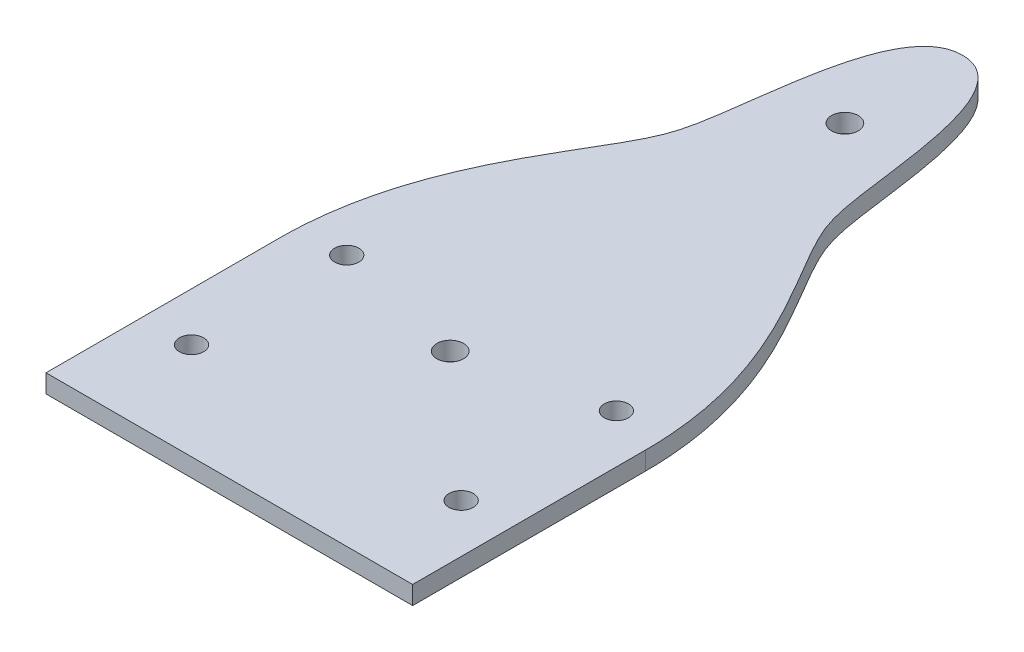
ISO-10303-21;
HEADER;
FILE_DESCRIPTION(('STEP AP214'),'2;1');
FILE_NAME('part.step','',(''),(''),'','','');
FILE_SCHEMA(('AUTOMOTIVE_DESIGN { 1 0 10303 214 1 1 1 1 }'));
ENDSEC;
DATA;
#1=APPLICATION_CONTEXT('core data for automotive mechanical design processes');
#2=APPLICATION_PROTOCOL_DEFINITION('international standard','automotive_design',2000,#1);
#3=PRODUCT_CONTEXT('',#1,'mechanical');
#4=PRODUCT('Part','Part','',(#3));
#5=PRODUCT_RELATED_PRODUCT_CATEGORY('part','',(#4));
#6=PRODUCT_DEFINITION_FORMATION('','',#4);
#7=PRODUCT_DEFINITION_CONTEXT('part definition',#1,'design');
#8=PRODUCT_DEFINITION('design','',#6,#7);
#9=PRODUCT_DEFINITION_SHAPE('','',#8);
#10=(LENGTH_UNIT() NAMED_UNIT(*) SI_UNIT(.MILLI.,.METRE.));
#11=(NAMED_UNIT(*) PLANE_ANGLE_UNIT() SI_UNIT($,.RADIAN.));
#12=(NAMED_UNIT(*) SI_UNIT($,.STERADIAN.) SOLID_ANGLE_UNIT());
#13=UNCERTAINTY_MEASURE_WITH_UNIT(LENGTH_MEASURE(1.E-05),#10,'distance_accuracy_value','');
#14=(GEOMETRIC_REPRESENTATION_CONTEXT(3) GLOBAL_UNCERTAINTY_ASSIGNED_CONTEXT((#13)) GLOBAL_UNIT_ASSIGNED_CONTEXT((#10,
#11,#12)) REPRESENTATION_CONTEXT('',''));
#15=CARTESIAN_POINT('',(0.,0.,0.));
#16=DIRECTION('',(0.,0.,1.));
#17=DIRECTION('',(1.,0.,0.));
#18=AXIS2_PLACEMENT_3D('',#15,#16,#17);
#19=CARTESIAN_POINT('',(-30.,3.,60.));
#20=DIRECTION('',(1.,0.,0.));
#21=DIRECTION('',(0.,0.,-1.));
#22=AXIS2_PLACEMENT_3D('',#19,#20,#21);
#23=PLANE('',#22);
#24=DIRECTION('',(0.,1.,0.));
#25=VECTOR('',#24,1.);
#26=CARTESIAN_POINT('',(-30.,0.,21.9));
#27=LINE('',#26,#25);
#28=CARTESIAN_POINT('',(-30.,0.,21.9));
#29=VERTEX_POINT('',#28);
#30=CARTESIAN_POINT('',(-30.,3.,21.9));
#31=VERTEX_POINT('',#30);
#32=EDGE_CURVE('E113',#29,#31,#27,.T.);
#33=ORIENTED_EDGE('',*,*,#32,.F.);
#34=DIRECTION('',(0.,0.,1.));
#35=VECTOR('',#34,1.);
#36=CARTESIAN_POINT('',(-30.,0.,60.));
#37=LINE('',#36,#35);
#38=CARTESIAN_POINT('',(-30.,0.,60.));
#39=VERTEX_POINT('',#38);
#40=EDGE_CURVE('E78',#29,#39,#37,.T.);
#41=ORIENTED_EDGE('',*,*,#40,.T.);
#42=DIRECTION('',(0.,-1.,0.));
#43=VECTOR('',#42,1.);
#44=CARTESIAN_POINT('',(-30.,3.,60.));
#45=LINE('',#44,#43);
#46=CARTESIAN_POINT('',(-30.,3.,60.));
#47=VERTEX_POINT('',#46);
#48=EDGE_CURVE('E11',#47,#39,#45,.T.);
#49=ORIENTED_EDGE('',*,*,#48,.F.);
#50=DIRECTION('',(0.,0.,1.));
#51=VECTOR('',#50,1.);
#52=CARTESIAN_POINT('',(-30.,3.,60.));
#53=LINE('',#52,#51);
#54=EDGE_CURVE('E94',#31,#47,#53,.T.);
#55=ORIENTED_EDGE('',*,*,#54,.F.);
#56=EDGE_LOOP('',(#33,#41,#49,#55));
#57=FACE_BOUND('',#56,.T.);
#58=ADVANCED_FACE('F33',(#57),#23,.F.);
#59=CARTESIAN_POINT('',(0.,3.,0.));
#60=DIRECTION('',(0.,-1.,0.));
#61=DIRECTION('',(0.,0.,-1.));
#62=AXIS2_PLACEMENT_3D('',#59,#60,#61);
#63=PLANE('',#62);
#64=CARTESIAN_POINT('',(-22.0625,3.,44.125));
#65=DIRECTION('',(0.,1.,0.));
#66=DIRECTION('',(0.,0.,-1.));
#67=AXIS2_PLACEMENT_3D('',#64,#65,#66);
#68=CIRCLE('',#67,1.98437499999999);
#69=CARTESIAN_POINT('',(-22.0625,3.,42.140625));
#70=VERTEX_POINT('',#69);
#71=EDGE_CURVE('E203',#70,#70,#68,.T.);
#72=ORIENTED_EDGE('',*,*,#71,.F.);
#73=EDGE_LOOP('',(#72));
#74=FACE_BOUND('',#73,.T.);
#75=CARTESIAN_POINT('',(-22.0625,3.,18.725));
#76=DIRECTION('',(0.,1.,0.));
#77=DIRECTION('',(0.,0.,-1.));
#78=AXIS2_PLACEMENT_3D('',#75,#76,#77);
#79=CIRCLE('',#78,1.984375);
#80=CARTESIAN_POINT('',(-22.0625,3.,16.740625));
#81=VERTEX_POINT('',#80);
#82=EDGE_CURVE('E197',#81,#81,#79,.T.);
#83=ORIENTED_EDGE('',*,*,#82,.F.);
#84=EDGE_LOOP('',(#83));
#85=FACE_BOUND('',#84,.T.);
#86=CARTESIAN_POINT('',(22.0625,3.,18.725));
#87=DIRECTION('',(0.,1.,0.));
#88=DIRECTION('',(0.,0.,1.));
#89=AXIS2_PLACEMENT_3D('',#86,#87,#88);
#90=CIRCLE('',#89,1.98437499999999);
#91=CARTESIAN_POINT('',(22.0625,3.,20.709375));
#92=VERTEX_POINT('',#91);
#93=EDGE_CURVE('E191',#92,#92,#90,.T.);
#94=ORIENTED_EDGE('',*,*,#93,.F.);
#95=EDGE_LOOP('',(#94));
#96=FACE_BOUND('',#95,.T.);
#97=CARTESIAN_POINT('',(22.0625,3.,44.125));
#98=DIRECTION('',(0.,1.,0.));
#99=DIRECTION('',(0.,0.,1.));
#100=AXIS2_PLACEMENT_3D('',#97,#98,#99);
#101=CIRCLE('',#100,1.98437499999999);
#102=CARTESIAN_POINT('',(22.0625,3.,46.109375));
#103=VERTEX_POINT('',#102);
#104=EDGE_CURVE('E174',#103,#103,#101,.T.);
#105=ORIENTED_EDGE('',*,*,#104,.F.);
#106=EDGE_LOOP('',(#105));
#107=FACE_BOUND('',#106,.T.);
#108=CARTESIAN_POINT('',(0.,3.,23.856));
#109=DIRECTION('',(0.,1.,0.));
#110=DIRECTION('',(0.,0.,1.));
#111=AXIS2_PLACEMENT_3D('',#108,#109,#110);
#112=CIRCLE('',#111,2.185);
#113=CARTESIAN_POINT('',(0.,3.,26.041));
#114=VERTEX_POINT('',#113);
#115=EDGE_CURVE('E90',#114,#114,#112,.T.);
#116=ORIENTED_EDGE('',*,*,#115,.F.);
#117=EDGE_LOOP('',(#116));
#118=FACE_BOUND('',#117,.T.);
#119=CARTESIAN_POINT('',(0.,3.,-40.736));
#120=DIRECTION('',(0.,1.,0.));
#121=DIRECTION('',(0.,0.,1.));
#122=AXIS2_PLACEMENT_3D('',#119,#120,#121);
#123=CIRCLE('',#122,2.185);
#124=CARTESIAN_POINT('',(0.,3.,-38.551));
#125=VERTEX_POINT('',#124);
#126=EDGE_CURVE('E100',#125,#125,#123,.T.);
#127=ORIENTED_EDGE('',*,*,#126,.F.);
#128=EDGE_LOOP('',(#127));
#129=FACE_BOUND('',#128,.T.);
#130=CARTESIAN_POINT('',(0.,3.,-60.));
#131=CARTESIAN_POINT('',(-9.90689767750797,3.,-60.));
#132=CARTESIAN_POINT('',(-10.1167384429209,3.,-32.5140317400472));
#133=CARTESIAN_POINT('',(-16.2163861159707,3.,-16.2532624187732));
#134=CARTESIAN_POINT('',(-30.0000000000001,3.,0.686105813744793));
#135=CARTESIAN_POINT('',(-30.,3.,21.9000000000002));
#136=B_SPLINE_CURVE_WITH_KNOTS('',3,(#130,#131,#132,#133,#134,#135),.UNSPECIFIED.,.F.,.F.,(4,1,
1,4),(0.,0.419462522765661,0.519462522765661,1.),.UNSPECIFIED.);
#137=CARTESIAN_POINT('',(0.,3.,-60.));
#138=VERTEX_POINT('',#137);
#139=EDGE_CURVE('E168',#138,#31,#136,.T.);
#140=ORIENTED_EDGE('',*,*,#139,.T.);
#141=ORIENTED_EDGE('',*,*,#54,.T.);
#142=DIRECTION('',(1.,0.,0.));
#143=VECTOR('',#142,1.);
#144=CARTESIAN_POINT('',(-30.,3.,60.));
#145=LINE('',#144,#143);
#146=CARTESIAN_POINT('',(30.,3.,60.));
#147=VERTEX_POINT('',#146);
#148=EDGE_CURVE('E57',#47,#147,#145,.T.);
#149=ORIENTED_EDGE('',*,*,#148,.T.);
#150=DIRECTION('',(0.,0.,-1.));
#151=VECTOR('',#150,1.);
#152=CARTESIAN_POINT('',(30.,3.,60.));
#153=LINE('',#152,#151);
#154=CARTESIAN_POINT('',(30.,3.,21.9));
#155=VERTEX_POINT('',#154);
#156=EDGE_CURVE('E77',#147,#155,#153,.T.);
#157=ORIENTED_EDGE('',*,*,#156,.T.);
#158=CARTESIAN_POINT('',(0.,3.,-60.));
#159=CARTESIAN_POINT('',(9.90689767750797,3.,-60.));
#160=CARTESIAN_POINT('',(10.1167384429209,3.,-32.5140317400472));
#161=CARTESIAN_POINT('',(16.2163861159707,3.,-16.2532624187732));
#162=CARTESIAN_POINT('',(30.0000000000001,3.,0.686105813744793));
#163=CARTESIAN_POINT('',(30.,3.,21.9000000000002));
#164=B_SPLINE_CURVE_WITH_KNOTS('',3,(#158,#159,#160,#161,#162,#163),.UNSPECIFIED.,.F.,.F.,(4,1,
1,4),(0.,0.419462522765661,0.519462522765661,1.),.UNSPECIFIED.);
#165=EDGE_CURVE('E109',#138,#155,#164,.T.);
#166=ORIENTED_EDGE('',*,*,#165,.F.);
#167=EDGE_LOOP('',(#140,#141,#149,#157,#166));
#168=FACE_BOUND('',#167,.T.);
#169=ADVANCED_FACE('F141',(#74,#85,#96,#107,#118,#129,#168),#63,.F.);
#170=CARTESIAN_POINT('',(0.,0.,0.));
#171=DIRECTION('',(0.,-1.,0.));
#172=DIRECTION('',(0.,0.,-1.));
#173=AXIS2_PLACEMENT_3D('',#170,#171,#172);
#174=PLANE('',#173);
#175=CARTESIAN_POINT('',(-22.0625,0.,44.125));
#176=DIRECTION('',(0.,1.,0.));
#177=DIRECTION('',(0.,0.,-1.));
#178=AXIS2_PLACEMENT_3D('',#175,#176,#177);
#179=CIRCLE('',#178,1.98437499999999);
#180=CARTESIAN_POINT('',(-22.0625,0.,42.140625));
#181=VERTEX_POINT('',#180);
#182=EDGE_CURVE('E200',#181,#181,#179,.T.);
#183=ORIENTED_EDGE('',*,*,#182,.T.);
#184=EDGE_LOOP('',(#183));
#185=FACE_BOUND('',#184,.T.);
#186=CARTESIAN_POINT('',(-22.0625,0.,18.725));
#187=DIRECTION('',(0.,1.,0.));
#188=DIRECTION('',(0.,0.,-1.));
#189=AXIS2_PLACEMENT_3D('',#186,#187,#188);
#190=CIRCLE('',#189,1.984375);
#191=CARTESIAN_POINT('',(-22.0625,0.,16.740625));
#192=VERTEX_POINT('',#191);
#193=EDGE_CURVE('E194',#192,#192,#190,.T.);
#194=ORIENTED_EDGE('',*,*,#193,.T.);
#195=EDGE_LOOP('',(#194));
#196=FACE_BOUND('',#195,.T.);
#197=CARTESIAN_POINT('',(22.0625,0.,18.725));
#198=DIRECTION('',(0.,1.,0.));
#199=DIRECTION('',(0.,0.,1.));
#200=AXIS2_PLACEMENT_3D('',#197,#198,#199);
#201=CIRCLE('',#200,1.98437499999999);
#202=CARTESIAN_POINT('',(22.0625,0.,20.709375));
#203=VERTEX_POINT('',#202);
#204=EDGE_CURVE('E189',#203,#203,#201,.T.);
#205=ORIENTED_EDGE('',*,*,#204,.T.);
#206=EDGE_LOOP('',(#205));
#207=FACE_BOUND('',#206,.T.);
#208=CARTESIAN_POINT('',(22.0625,0.,44.125));
#209=DIRECTION('',(0.,1.,0.));
#210=DIRECTION('',(0.,0.,1.));
#211=AXIS2_PLACEMENT_3D('',#208,#209,#210);
#212=CIRCLE('',#211,1.98437499999999);
#213=CARTESIAN_POINT('',(22.0625,0.,46.109375));
#214=VERTEX_POINT('',#213);
#215=EDGE_CURVE('E172',#214,#214,#212,.T.);
#216=ORIENTED_EDGE('',*,*,#215,.T.);
#217=EDGE_LOOP('',(#216));
#218=FACE_BOUND('',#217,.T.);
#219=CARTESIAN_POINT('',(0.,0.,-40.736));
#220=DIRECTION('',(0.,1.,0.));
#221=DIRECTION('',(0.,0.,1.));
#222=AXIS2_PLACEMENT_3D('',#219,#220,#221);
#223=CIRCLE('',#222,2.185);
#224=CARTESIAN_POINT('',(0.,0.,-38.551));
#225=VERTEX_POINT('',#224);
#226=EDGE_CURVE('E98',#225,#225,#223,.T.);
#227=ORIENTED_EDGE('',*,*,#226,.T.);
#228=EDGE_LOOP('',(#227));
#229=FACE_BOUND('',#228,.T.);
#230=CARTESIAN_POINT('',(0.,0.,23.856));
#231=DIRECTION('',(0.,1.,0.));
#232=DIRECTION('',(0.,0.,1.));
#233=AXIS2_PLACEMENT_3D('',#230,#231,#232);
#234=CIRCLE('',#233,2.185);
#235=CARTESIAN_POINT('',(0.,0.,26.041));
#236=VERTEX_POINT('',#235);
#237=EDGE_CURVE('E86',#236,#236,#234,.T.);
#238=ORIENTED_EDGE('',*,*,#237,.T.);
#239=EDGE_LOOP('',(#238));
#240=FACE_BOUND('',#239,.T.);
#241=ORIENTED_EDGE('',*,*,#40,.F.);
#242=CARTESIAN_POINT('',(0.,0.,-60.));
#243=CARTESIAN_POINT('',(-9.90689767750797,0.,-60.));
#244=CARTESIAN_POINT('',(-10.1167384429209,0.,-32.5140317400472));
#245=CARTESIAN_POINT('',(-16.2163861159707,0.,-16.2532624187732));
#246=CARTESIAN_POINT('',(-30.0000000000001,0.,0.686105813744793));
#247=CARTESIAN_POINT('',(-30.,0.,21.9000000000002));
#248=B_SPLINE_CURVE_WITH_KNOTS('',3,(#242,#243,#244,#245,#246,#247),.UNSPECIFIED.,.F.,.F.,(4,1,
1,4),(0.,0.419462522765661,0.519462522765661,1.),.UNSPECIFIED.);
#249=CARTESIAN_POINT('',(0.,0.,-60.));
#250=VERTEX_POINT('',#249);
#251=EDGE_CURVE('E165',#250,#29,#248,.T.);
#252=ORIENTED_EDGE('',*,*,#251,.F.);
#253=CARTESIAN_POINT('',(0.,0.,-60.));
#254=CARTESIAN_POINT('',(9.90689767750797,0.,-60.));
#255=CARTESIAN_POINT('',(10.1167384429209,0.,-32.5140317400472));
#256=CARTESIAN_POINT('',(16.2163861159707,0.,-16.2532624187732));
#257=CARTESIAN_POINT('',(30.0000000000001,0.,0.686105813744793));
#258=CARTESIAN_POINT('',(30.,0.,21.9000000000002));
#259=B_SPLINE_CURVE_WITH_KNOTS('',3,(#253,#254,#255,#256,#257,#258),.UNSPECIFIED.,.F.,.F.,(4,1,
1,4),(0.,0.419462522765661,0.519462522765661,1.),.UNSPECIFIED.);
#260=CARTESIAN_POINT('',(30.,0.,21.9));
#261=VERTEX_POINT('',#260);
#262=EDGE_CURVE('E85',#250,#261,#259,.T.);
#263=ORIENTED_EDGE('',*,*,#262,.T.);
#264=DIRECTION('',(0.,0.,-1.));
#265=VECTOR('',#264,1.);
#266=CARTESIAN_POINT('',(30.,0.,60.));
#267=LINE('',#266,#265);
#268=CARTESIAN_POINT('',(30.,0.,60.));
#269=VERTEX_POINT('',#268);
#270=EDGE_CURVE('E82',#269,#261,#267,.T.);
#271=ORIENTED_EDGE('',*,*,#270,.F.);
#272=DIRECTION('',(1.,0.,0.));
#273=VECTOR('',#272,1.);
#274=CARTESIAN_POINT('',(-30.,0.,60.));
#275=LINE('',#274,#273);
#276=EDGE_CURVE('E69',#39,#269,#275,.T.);
#277=ORIENTED_EDGE('',*,*,#276,.F.);
#278=EDGE_LOOP('',(#241,#252,#263,#271,#277));
#279=FACE_BOUND('',#278,.T.);
#280=ADVANCED_FACE('F83',(#185,#196,#207,#218,#229,#240,#279),#174,.T.);
#281=CARTESIAN_POINT('',(30.,3.,60.));
#282=DIRECTION('',(-1.,0.,0.));
#283=DIRECTION('',(0.,0.,1.));
#284=AXIS2_PLACEMENT_3D('',#281,#282,#283);
#285=PLANE('',#284);
#286=ORIENTED_EDGE('',*,*,#270,.T.);
#287=DIRECTION('',(0.,1.,0.));
#288=VECTOR('',#287,1.);
#289=CARTESIAN_POINT('',(30.,0.,21.9));
#290=LINE('',#289,#288);
#291=EDGE_CURVE('E48',#261,#155,#290,.T.);
#292=ORIENTED_EDGE('',*,*,#291,.T.);
#293=ORIENTED_EDGE('',*,*,#156,.F.);
#294=DIRECTION('',(0.,-1.,0.));
#295=VECTOR('',#294,1.);
#296=CARTESIAN_POINT('',(30.,3.,60.));
#297=LINE('',#296,#295);
#298=EDGE_CURVE('E41',#147,#269,#297,.T.);
#299=ORIENTED_EDGE('',*,*,#298,.T.);
#300=EDGE_LOOP('',(#286,#292,#293,#299));
#301=FACE_BOUND('',#300,.T.);
#302=ADVANCED_FACE('F35',(#301),#285,.F.);
#303=CARTESIAN_POINT('',(-30.,3.,60.));
#304=DIRECTION('',(0.,0.,-1.));
#305=DIRECTION('',(-1.,0.,0.));
#306=AXIS2_PLACEMENT_3D('',#303,#304,#305);
#307=PLANE('',#306);
#308=ORIENTED_EDGE('',*,*,#276,.T.);
#309=ORIENTED_EDGE('',*,*,#298,.F.);
#310=ORIENTED_EDGE('',*,*,#148,.F.);
#311=ORIENTED_EDGE('',*,*,#48,.T.);
#312=EDGE_LOOP('',(#308,#309,#310,#311));
#313=FACE_BOUND('',#312,.T.);
#314=ADVANCED_FACE('F71',(#313),#307,.F.);
#315=CARTESIAN_POINT('',(0.,0.,23.856));
#316=DIRECTION('',(0.,1.,0.));
#317=DIRECTION('',(0.,0.,1.));
#318=AXIS2_PLACEMENT_3D('',#315,#316,#317);
#319=CYLINDRICAL_SURFACE('',#318,2.185);
#320=ORIENTED_EDGE('',*,*,#237,.F.);
#321=EDGE_LOOP('',(#320));
#322=FACE_BOUND('',#321,.T.);
#323=ORIENTED_EDGE('',*,*,#115,.T.);
#324=EDGE_LOOP('',(#323));
#325=FACE_BOUND('',#324,.T.);
#326=ADVANCED_FACE('F136',(#322,#325),#319,.F.);
#327=CARTESIAN_POINT('',(0.,0.,-40.736));
#328=DIRECTION('',(0.,1.,0.));
#329=DIRECTION('',(0.,0.,1.));
#330=AXIS2_PLACEMENT_3D('',#327,#328,#329);
#331=CYLINDRICAL_SURFACE('',#330,2.185);
#332=ORIENTED_EDGE('',*,*,#226,.F.);
#333=EDGE_LOOP('',(#332));
#334=FACE_BOUND('',#333,.T.);
#335=ORIENTED_EDGE('',*,*,#126,.T.);
#336=EDGE_LOOP('',(#335));
#337=FACE_BOUND('',#336,.T.);
#338=ADVANCED_FACE('F131',(#334,#337),#331,.F.);
#339=DIRECTION('',(0.,1.,0.));
#340=VECTOR('',#339,1.);
#341=SURFACE_OF_LINEAR_EXTRUSION('',#259,#340);
#342=ORIENTED_EDGE('',*,*,#165,.T.);
#343=ORIENTED_EDGE('',*,*,#291,.F.);
#344=ORIENTED_EDGE('',*,*,#262,.F.);
#345=DIRECTION('',(0.,1.,0.));
#346=VECTOR('',#345,1.);
#347=CARTESIAN_POINT('',(0.,0.,-60.));
#348=LINE('',#347,#346);
#349=EDGE_CURVE('E103',#250,#138,#348,.T.);
#350=ORIENTED_EDGE('',*,*,#349,.T.);
#351=EDGE_LOOP('',(#342,#343,#344,#350));
#352=FACE_BOUND('',#351,.T.);
#353=ADVANCED_FACE('F126',(#352),#341,.F.);
#354=DIRECTION('',(0.,1.,0.));
#355=VECTOR('',#354,1.);
#356=SURFACE_OF_LINEAR_EXTRUSION('',#248,#355);
#357=ORIENTED_EDGE('',*,*,#139,.F.);
#358=ORIENTED_EDGE('',*,*,#349,.F.);
#359=ORIENTED_EDGE('',*,*,#251,.T.);
#360=ORIENTED_EDGE('',*,*,#32,.T.);
#361=EDGE_LOOP('',(#357,#358,#359,#360));
#362=FACE_BOUND('',#361,.T.);
#363=ADVANCED_FACE('F130',(#362),#356,.T.);
#364=CARTESIAN_POINT('',(22.0625,0.,44.125));
#365=DIRECTION('',(0.,1.,0.));
#366=DIRECTION('',(0.,0.,1.));
#367=AXIS2_PLACEMENT_3D('',#364,#365,#366);
#368=CYLINDRICAL_SURFACE('',#367,1.98437499999999);
#369=ORIENTED_EDGE('',*,*,#215,.F.);
#370=EDGE_LOOP('',(#369));
#371=FACE_BOUND('',#370,.T.);
#372=ORIENTED_EDGE('',*,*,#104,.T.);
#373=EDGE_LOOP('',(#372));
#374=FACE_BOUND('',#373,.T.);
#375=ADVANCED_FACE('F229',(#371,#374),#368,.F.);
#376=CARTESIAN_POINT('',(22.0625,0.,18.725));
#377=DIRECTION('',(0.,1.,0.));
#378=DIRECTION('',(0.,0.,1.));
#379=AXIS2_PLACEMENT_3D('',#376,#377,#378);
#380=CYLINDRICAL_SURFACE('',#379,1.98437499999999);
#381=ORIENTED_EDGE('',*,*,#204,.F.);
#382=EDGE_LOOP('',(#381));
#383=FACE_BOUND('',#382,.T.);
#384=ORIENTED_EDGE('',*,*,#93,.T.);
#385=EDGE_LOOP('',(#384));
#386=FACE_BOUND('',#385,.T.);
#387=ADVANCED_FACE('F231',(#383,#386),#380,.F.);
#388=CARTESIAN_POINT('',(-22.0625,0.,18.725));
#389=DIRECTION('',(0.,1.,0.));
#390=DIRECTION('',(0.,0.,1.));
#391=AXIS2_PLACEMENT_3D('',#388,#389,#390);
#392=CYLINDRICAL_SURFACE('',#391,1.984375);
#393=ORIENTED_EDGE('',*,*,#193,.F.);
#394=EDGE_LOOP('',(#393));
#395=FACE_BOUND('',#394,.T.);
#396=ORIENTED_EDGE('',*,*,#82,.T.);
#397=EDGE_LOOP('',(#396));
#398=FACE_BOUND('',#397,.T.);
#399=ADVANCED_FACE('F213',(#395,#398),#392,.F.);
#400=CARTESIAN_POINT('',(-22.0625,0.,44.125));
#401=DIRECTION('',(0.,1.,0.));
#402=DIRECTION('',(0.,0.,1.));
#403=AXIS2_PLACEMENT_3D('',#400,#401,#402);
#404=CYLINDRICAL_SURFACE('',#403,1.98437499999999);
#405=ORIENTED_EDGE('',*,*,#182,.F.);
#406=EDGE_LOOP('',(#405));
#407=FACE_BOUND('',#406,.T.);
#408=ORIENTED_EDGE('',*,*,#71,.T.);
#409=EDGE_LOOP('',(#408));
#410=FACE_BOUND('',#409,.T.);
#411=ADVANCED_FACE('F210',(#407,#410),#404,.F.);
#412=CLOSED_SHELL('',(#58,#169,#280,#302,#314,#326,#338,#353,#363,#375,#387,#399,#411));
#413=MANIFOLD_SOLID_BREP('B2',#412);
#414=ADVANCED_BREP_SHAPE_REPRESENTATION('',(#18,#413),#14);
#415=SHAPE_DEFINITION_REPRESENTATION(#9,#414);
ENDSEC;
END-ISO-10303-21;
